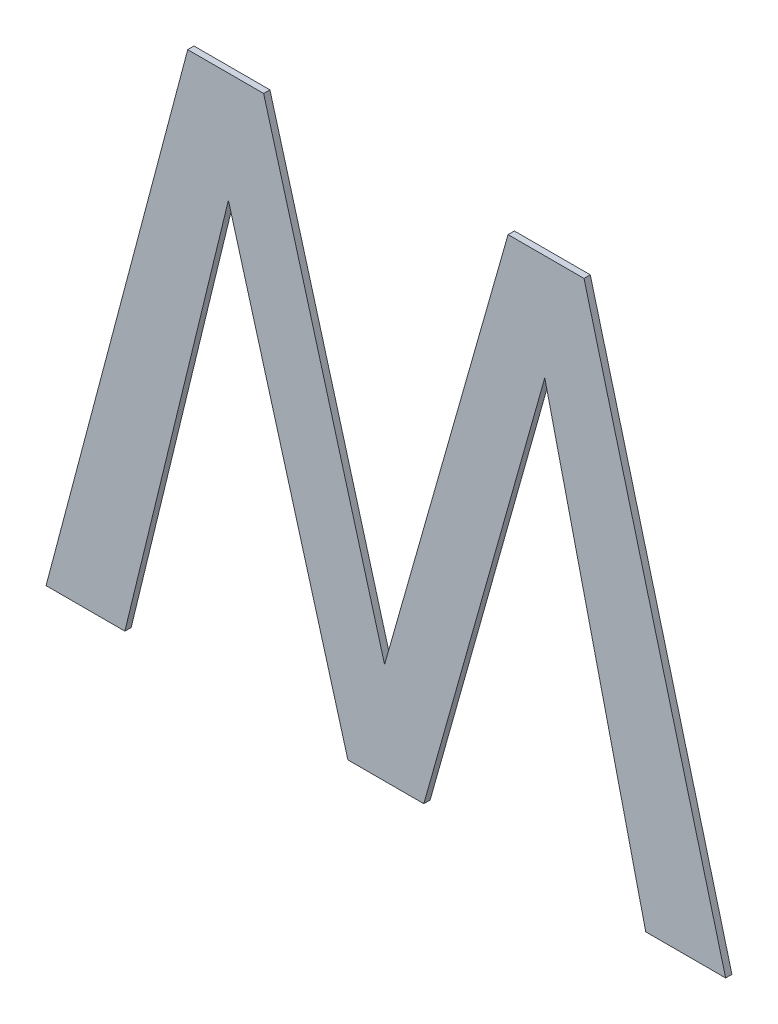
ISO-10303-21;
HEADER;
FILE_DESCRIPTION(('STEP AP214'),'2;1');
FILE_NAME('part.step','',(''),(''),'','','');
FILE_SCHEMA(('AUTOMOTIVE_DESIGN { 1 0 10303 214 1 1 1 1 }'));
ENDSEC;
DATA;
#1=APPLICATION_CONTEXT('core data for automotive mechanical design processes');
#2=APPLICATION_PROTOCOL_DEFINITION('international standard','automotive_design',2000,#1);
#3=PRODUCT_CONTEXT('',#1,'mechanical');
#4=PRODUCT('Part','Part','',(#3));
#5=PRODUCT_RELATED_PRODUCT_CATEGORY('part','',(#4));
#6=PRODUCT_DEFINITION_FORMATION('','',#4);
#7=PRODUCT_DEFINITION_CONTEXT('part definition',#1,'design');
#8=PRODUCT_DEFINITION('design','',#6,#7);
#9=PRODUCT_DEFINITION_SHAPE('','',#8);
#10=(LENGTH_UNIT() NAMED_UNIT(*) SI_UNIT(.MILLI.,.METRE.));
#11=(NAMED_UNIT(*) PLANE_ANGLE_UNIT() SI_UNIT($,.RADIAN.));
#12=(NAMED_UNIT(*) SI_UNIT($,.STERADIAN.) SOLID_ANGLE_UNIT());
#13=UNCERTAINTY_MEASURE_WITH_UNIT(LENGTH_MEASURE(1.E-05),#10,'distance_accuracy_value','');
#14=(GEOMETRIC_REPRESENTATION_CONTEXT(3) GLOBAL_UNCERTAINTY_ASSIGNED_CONTEXT((#13)) GLOBAL_UNIT_ASSIGNED_CONTEXT((#10,
#11,#12)) REPRESENTATION_CONTEXT('',''));
#15=CARTESIAN_POINT('',(0.,0.,0.));
#16=DIRECTION('',(0.,0.,1.));
#17=DIRECTION('',(1.,0.,0.));
#18=AXIS2_PLACEMENT_3D('',#15,#16,#17);
#19=CARTESIAN_POINT('',(0.855597944876126,0.0653781223592418,-3.53695));
#20=DIRECTION('',(0.,0.,1.));
#21=DIRECTION('',(1.,0.,0.));
#22=AXIS2_PLACEMENT_3D('',#19,#20,#21);
#23=PLANE('',#22);
#24=DIRECTION('',(-0.268433706450194,0.96329816009448,0.));
#25=VECTOR('',#24,1.);
#26=CARTESIAN_POINT('',(0.793295570871268,0.116319490612344,-3.53695));
#27=LINE('',#26,#25);
#28=CARTESIAN_POINT('',(0.854315267318052,-0.102655101267517,-3.53695));
#29=VERTEX_POINT('',#28);
#30=CARTESIAN_POINT('',(0.73227587442447,0.335294082492275,-3.53695));
#31=VERTEX_POINT('',#30);
#32=EDGE_CURVE('E170',#29,#31,#27,.T.);
#33=ORIENTED_EDGE('',*,*,#32,.F.);
#34=DIRECTION('',(0.273657890492406,0.961827094113722,0.));
#35=VECTOR('',#34,1.);
#36=CARTESIAN_POINT('',(0.916617655400088,0.116319490612395,-3.53695));
#37=LINE('',#36,#35);
#38=CARTESIAN_POINT('',(0.978920043482131,0.335294082492283,-3.53695));
#39=VERTEX_POINT('',#38);
#40=EDGE_CURVE('E163',#29,#39,#37,.T.);
#41=ORIENTED_EDGE('',*,*,#40,.T.);
#42=DIRECTION('',(1.,0.,0.));
#43=VECTOR('',#42,1.);
#44=CARTESIAN_POINT('',(1.01721769222704,0.335294082492282,-3.53695));
#45=LINE('',#44,#43);
#46=CARTESIAN_POINT('',(1.05551534097171,0.335294082492285,-3.53695));
#47=VERTEX_POINT('',#46);
#48=EDGE_CURVE('E160',#47,#39,#45,.F.);
#49=ORIENTED_EDGE('',*,*,#48,.F.);
#50=DIRECTION('',(-0.255946634271697,0.966690912549089,0.));
#51=VECTOR('',#50,1.);
#52=CARTESIAN_POINT('',(1.1269798397432,0.0653781223592418,-3.53695));
#53=LINE('',#52,#51);
#54=CARTESIAN_POINT('',(1.1984443385147,-0.204537837773794,-3.53695));
#55=VERTEX_POINT('',#54);
#56=EDGE_CURVE('E155',#55,#47,#53,.T.);
#57=ORIENTED_EDGE('',*,*,#56,.F.);
#58=DIRECTION('',(1.,0.,0.));
#59=VECTOR('',#58,1.);
#60=CARTESIAN_POINT('',(1.15813102573992,-0.204537837773798,-3.53695));
#61=LINE('',#60,#59);
#62=CARTESIAN_POINT('',(1.11781771296539,-0.204537837773784,-3.53695));
#63=VERTEX_POINT('',#62);
#64=EDGE_CURVE('E148',#55,#63,#61,.F.);
#65=ORIENTED_EDGE('',*,*,#64,.T.);
#66=DIRECTION('',(-0.228947452945893,0.973438782764272,0.));
#67=VECTOR('',#66,1.);
#68=CARTESIAN_POINT('',(1.06687636080054,0.0120546038789736,-3.53695));
#69=LINE('',#68,#67);
#70=CARTESIAN_POINT('',(1.01593500863569,0.22864704553169,-3.53695));
#71=VERTEX_POINT('',#70);
#72=EDGE_CURVE('E144',#63,#71,#69,.T.);
#73=ORIENTED_EDGE('',*,*,#72,.T.);
#74=DIRECTION('',(0.271170057622003,0.96253145395321,0.));
#75=VECTOR('',#74,1.);
#76=CARTESIAN_POINT('',(0.954915304144744,0.0120546038789457,-3.53695));
#77=LINE('',#76,#75);
#78=CARTESIAN_POINT('',(0.893895599653794,-0.204537837773793,-3.53695));
#79=VERTEX_POINT('',#78);
#80=EDGE_CURVE('E141',#79,#71,#77,.T.);
#81=ORIENTED_EDGE('',*,*,#80,.F.);
#82=DIRECTION('',(1.,0.,0.));
#83=VECTOR('',#82,1.);
#84=CARTESIAN_POINT('',(0.855597950909134,-0.204537837773798,-3.53695));
#85=LINE('',#84,#83);
#86=CARTESIAN_POINT('',(0.817300302164499,-0.20453783777378,-3.53695));
#87=VERTEX_POINT('',#86);
#88=EDGE_CURVE('E134',#79,#87,#85,.F.);
#89=ORIENTED_EDGE('',*,*,#88,.T.);
#90=DIRECTION('',(-0.270697903798296,0.962664346945086,0.));
#91=VECTOR('',#90,1.);
#92=CARTESIAN_POINT('',(0.75701357811231,0.0098556947393712,-3.53695));
#93=LINE('',#92,#91);
#94=CARTESIAN_POINT('',(0.696726854060111,0.224249227252537,-3.53695));
#95=VERTEX_POINT('',#94);
#96=EDGE_CURVE('E109',#87,#95,#93,.T.);
#97=ORIENTED_EDGE('',*,*,#96,.T.);
#98=DIRECTION('',(0.236669409255408,0.971590238075032,0.));
#99=VECTOR('',#98,1.);
#100=CARTESIAN_POINT('',(0.644502790149576,0.0098556947393712,-3.53695));
#101=LINE('',#100,#99);
#102=CARTESIAN_POINT('',(0.59227872623902,-0.204537837773801,-3.53695));
#103=VERTEX_POINT('',#102);
#104=EDGE_CURVE('E121',#103,#95,#101,.T.);
#105=ORIENTED_EDGE('',*,*,#104,.F.);
#106=DIRECTION('',(1.,0.,0.));
#107=VECTOR('',#106,1.);
#108=CARTESIAN_POINT('',(0.55251513873815,-0.204537837773798,-3.53695));
#109=LINE('',#108,#107);
#110=CARTESIAN_POINT('',(0.512751551237545,-0.204537837773799,-3.53695));
#111=VERTEX_POINT('',#110);
#112=EDGE_CURVE('E19',#103,#111,#109,.F.);
#113=ORIENTED_EDGE('',*,*,#112,.T.);
#114=DIRECTION('',(0.255946681385797,0.966690900074888,0.));
#115=VECTOR('',#114,1.);
#116=CARTESIAN_POINT('',(0.584216064086236,0.0653781223592418,-3.53695));
#117=LINE('',#116,#115);
#118=CARTESIAN_POINT('',(0.655680576934927,0.335294082492282,-3.53695));
#119=VERTEX_POINT('',#118);
#120=EDGE_CURVE('E177',#111,#119,#117,.T.);
#121=ORIENTED_EDGE('',*,*,#120,.T.);
#122=DIRECTION('',(1.,0.,0.));
#123=VECTOR('',#122,1.);
#124=CARTESIAN_POINT('',(0.693978225679584,0.335294082492282,-3.53695));
#125=LINE('',#124,#123);
#126=EDGE_CURVE('E175',#31,#119,#125,.F.);
#127=ORIENTED_EDGE('',*,*,#126,.F.);
#128=EDGE_LOOP('',(#33,#41,#49,#57,#65,#73,#81,#89,#97,#105,#113,#121,#127));
#129=FACE_BOUND('',#128,.T.);
#130=ADVANCED_FACE('F16',(#129),#23,.F.);
#131=CARTESIAN_POINT('',(0.55251513873815,-0.204537837773798,-3.533775));
#132=DIRECTION('',(0.,1.,0.));
#133=DIRECTION('',(0.,0.,1.));
#134=AXIS2_PLACEMENT_3D('',#131,#132,#133);
#135=PLANE('',#134);
#136=DIRECTION('',(1.,0.,0.));
#137=VECTOR('',#136,1.);
#138=CARTESIAN_POINT('',(0.855597944876126,-0.204537837773798,-3.5306));
#139=LINE('',#138,#137);
#140=CARTESIAN_POINT('',(0.512751551237545,-0.204537837773799,-3.5306));
#141=VERTEX_POINT('',#140);
#142=CARTESIAN_POINT('',(0.59227872623902,-0.204537837773801,-3.5306));
#143=VERTEX_POINT('',#142);
#144=EDGE_CURVE('E181',#141,#143,#139,.T.);
#145=ORIENTED_EDGE('',*,*,#144,.F.);
#146=DIRECTION('',(0.,0.,1.));
#147=VECTOR('',#146,1.);
#148=CARTESIAN_POINT('',(0.512751551237547,-0.204537837773799,-3.533775));
#149=LINE('',#148,#147);
#150=EDGE_CURVE('E119',#141,#111,#149,.F.);
#151=ORIENTED_EDGE('',*,*,#150,.T.);
#152=ORIENTED_EDGE('',*,*,#112,.F.);
#153=DIRECTION('',(0.,0.,1.));
#154=VECTOR('',#153,1.);
#155=CARTESIAN_POINT('',(0.592278726239049,-0.204537837773808,-3.533775));
#156=LINE('',#155,#154);
#157=EDGE_CURVE('E116',#143,#103,#156,.F.);
#158=ORIENTED_EDGE('',*,*,#157,.F.);
#159=EDGE_LOOP('',(#145,#151,#152,#158));
#160=FACE_BOUND('',#159,.T.);
#161=ADVANCED_FACE('F114',(#160),#135,.F.);
#162=CARTESIAN_POINT('',(0.644502790149576,0.0098556947393712,-3.533775));
#163=DIRECTION('',(0.971590238075032,-0.236669409255408,0.));
#164=DIRECTION('',(0.236669409255408,0.971590238075032,0.));
#165=AXIS2_PLACEMENT_3D('',#162,#163,#164);
#166=PLANE('',#165);
#167=ORIENTED_EDGE('',*,*,#157,.T.);
#168=ORIENTED_EDGE('',*,*,#104,.T.);
#169=DIRECTION('',(0.,0.,1.));
#170=VECTOR('',#169,1.);
#171=CARTESIAN_POINT('',(0.696726854060057,0.224249227252517,-3.533775));
#172=LINE('',#171,#170);
#173=CARTESIAN_POINT('',(0.696726854060101,0.22424922725254,-3.5306));
#174=VERTEX_POINT('',#173);
#175=EDGE_CURVE('E132',#95,#174,#172,.T.);
#176=ORIENTED_EDGE('',*,*,#175,.T.);
#177=DIRECTION('',(0.236669409255586,0.971590238074988,0.));
#178=VECTOR('',#177,1.);
#179=CARTESIAN_POINT('',(0.59227872623901,-0.204537837773798,-3.5306));
#180=LINE('',#179,#178);
#181=EDGE_CURVE('E128',#143,#174,#180,.T.);
#182=ORIENTED_EDGE('',*,*,#181,.F.);
#183=EDGE_LOOP('',(#167,#168,#176,#182));
#184=FACE_BOUND('',#183,.T.);
#185=ADVANCED_FACE('F126',(#184),#166,.T.);
#186=CARTESIAN_POINT('',(0.75701357811231,0.0098556947393712,-3.533775));
#187=DIRECTION('',(0.962664346945086,0.270697903798296,0.));
#188=DIRECTION('',(-0.270697903798296,0.962664346945086,0.));
#189=AXIS2_PLACEMENT_3D('',#186,#187,#188);
#190=PLANE('',#189);
#191=DIRECTION('',(0.270697903797916,-0.962664346945193,0.));
#192=VECTOR('',#191,1.);
#193=CARTESIAN_POINT('',(0.696726854060142,0.224249227252541,-3.5306));
#194=LINE('',#193,#192);
#195=CARTESIAN_POINT('',(0.81730030216452,-0.204537837773786,-3.5306));
#196=VERTEX_POINT('',#195);
#197=EDGE_CURVE('E184',#174,#196,#194,.T.);
#198=ORIENTED_EDGE('',*,*,#197,.F.);
#199=ORIENTED_EDGE('',*,*,#175,.F.);
#200=ORIENTED_EDGE('',*,*,#96,.F.);
#201=DIRECTION('',(0.,0.,1.));
#202=VECTOR('',#201,1.);
#203=CARTESIAN_POINT('',(0.817300302164478,-0.204537837773798,-3.533775));
#204=LINE('',#203,#202);
#205=EDGE_CURVE('E136',#87,#196,#204,.T.);
#206=ORIENTED_EDGE('',*,*,#205,.T.);
#207=EDGE_LOOP('',(#198,#199,#200,#206));
#208=FACE_BOUND('',#207,.T.);
#209=ADVANCED_FACE('F260',(#208),#190,.F.);
#210=CARTESIAN_POINT('',(0.855597950909134,-0.204537837773798,-3.533775));
#211=DIRECTION('',(0.,1.,0.));
#212=DIRECTION('',(0.,0.,1.));
#213=AXIS2_PLACEMENT_3D('',#210,#211,#212);
#214=PLANE('',#213);
#215=DIRECTION('',(1.,0.,0.));
#216=VECTOR('',#215,1.);
#217=CARTESIAN_POINT('',(0.855597944876126,-0.204537837773798,-3.5306));
#218=LINE('',#217,#216);
#219=CARTESIAN_POINT('',(0.893895599653792,-0.204537837773799,-3.5306));
#220=VERTEX_POINT('',#219);
#221=EDGE_CURVE('E187',#196,#220,#218,.T.);
#222=ORIENTED_EDGE('',*,*,#221,.F.);
#223=ORIENTED_EDGE('',*,*,#205,.F.);
#224=ORIENTED_EDGE('',*,*,#88,.F.);
#225=DIRECTION('',(0.,0.,1.));
#226=VECTOR('',#225,1.);
#227=CARTESIAN_POINT('',(0.893895599653798,-0.204537837773801,-3.533775));
#228=LINE('',#227,#226);
#229=EDGE_CURVE('E138',#220,#79,#228,.F.);
#230=ORIENTED_EDGE('',*,*,#229,.F.);
#231=EDGE_LOOP('',(#222,#223,#224,#230));
#232=FACE_BOUND('',#231,.T.);
#233=ADVANCED_FACE('F256',(#232),#214,.F.);
#234=CARTESIAN_POINT('',(0.954915304144744,0.0120546038789457,-3.533775));
#235=DIRECTION('',(0.96253145395321,-0.271170057622003,0.));
#236=DIRECTION('',(0.271170057622003,0.96253145395321,0.));
#237=AXIS2_PLACEMENT_3D('',#234,#235,#236);
#238=PLANE('',#237);
#239=ORIENTED_EDGE('',*,*,#229,.T.);
#240=ORIENTED_EDGE('',*,*,#80,.T.);
#241=DIRECTION('',(0.,0.,1.));
#242=VECTOR('',#241,1.);
#243=CARTESIAN_POINT('',(1.01593500863569,0.228647045531688,-3.533775));
#244=LINE('',#243,#242);
#245=CARTESIAN_POINT('',(1.01593500863569,0.22864704553169,-3.5306));
#246=VERTEX_POINT('',#245);
#247=EDGE_CURVE('E146',#71,#246,#244,.T.);
#248=ORIENTED_EDGE('',*,*,#247,.T.);
#249=DIRECTION('',(0.271170057622038,0.9625314539532,0.));
#250=VECTOR('',#249,1.);
#251=CARTESIAN_POINT('',(0.89389559965379,-0.204537837773798,-3.5306));
#252=LINE('',#251,#250);
#253=EDGE_CURVE('E190',#220,#246,#252,.T.);
#254=ORIENTED_EDGE('',*,*,#253,.F.);
#255=EDGE_LOOP('',(#239,#240,#248,#254));
#256=FACE_BOUND('',#255,.T.);
#257=ADVANCED_FACE('F252',(#256),#238,.T.);
#258=CARTESIAN_POINT('',(1.06687636080054,0.0120546038789736,-3.533775));
#259=DIRECTION('',(0.973438782764272,0.228947452945893,0.));
#260=DIRECTION('',(-0.228947452945893,0.973438782764272,0.));
#261=AXIS2_PLACEMENT_3D('',#258,#259,#260);
#262=PLANE('',#261);
#263=DIRECTION('',(0.228947452945823,-0.973438782764289,0.));
#264=VECTOR('',#263,1.);
#265=CARTESIAN_POINT('',(1.0159350086357,0.22864704553169,-3.5306));
#266=LINE('',#265,#264);
#267=CARTESIAN_POINT('',(1.1178177129654,-0.204537837773796,-3.5306));
#268=VERTEX_POINT('',#267);
#269=EDGE_CURVE('E193',#246,#268,#266,.T.);
#270=ORIENTED_EDGE('',*,*,#269,.F.);
#271=ORIENTED_EDGE('',*,*,#247,.F.);
#272=ORIENTED_EDGE('',*,*,#72,.F.);
#273=DIRECTION('',(0.,0.,1.));
#274=VECTOR('',#273,1.);
#275=CARTESIAN_POINT('',(1.11781771296539,-0.204537837773798,-3.533775));
#276=LINE('',#275,#274);
#277=EDGE_CURVE('E150',#63,#268,#276,.T.);
#278=ORIENTED_EDGE('',*,*,#277,.T.);
#279=EDGE_LOOP('',(#270,#271,#272,#278));
#280=FACE_BOUND('',#279,.T.);
#281=ADVANCED_FACE('F248',(#280),#262,.F.);
#282=CARTESIAN_POINT('',(1.15813102573992,-0.204537837773798,-3.533775));
#283=DIRECTION('',(0.,1.,0.));
#284=DIRECTION('',(0.,0.,1.));
#285=AXIS2_PLACEMENT_3D('',#282,#283,#284);
#286=PLANE('',#285);
#287=DIRECTION('',(1.,0.,0.));
#288=VECTOR('',#287,1.);
#289=CARTESIAN_POINT('',(0.855597944876126,-0.204537837773798,-3.5306));
#290=LINE('',#289,#288);
#291=CARTESIAN_POINT('',(1.1984443385147,-0.2045378377738,-3.5306));
#292=VERTEX_POINT('',#291);
#293=EDGE_CURVE('E196',#268,#292,#290,.T.);
#294=ORIENTED_EDGE('',*,*,#293,.F.);
#295=ORIENTED_EDGE('',*,*,#277,.F.);
#296=ORIENTED_EDGE('',*,*,#64,.F.);
#297=DIRECTION('',(0.,0.,1.));
#298=VECTOR('',#297,1.);
#299=CARTESIAN_POINT('',(1.19844433851469,-0.204537837773804,-3.533775));
#300=LINE('',#299,#298);
#301=EDGE_CURVE('E152',#292,#55,#300,.F.);
#302=ORIENTED_EDGE('',*,*,#301,.F.);
#303=EDGE_LOOP('',(#294,#295,#296,#302));
#304=FACE_BOUND('',#303,.T.);
#305=ADVANCED_FACE('F244',(#304),#286,.F.);
#306=CARTESIAN_POINT('',(1.1269798397432,0.0653781223592418,-3.533775));
#307=DIRECTION('',(0.966690912549089,0.255946634271697,0.));
#308=DIRECTION('',(-0.255946634271697,0.966690912549089,0.));
#309=AXIS2_PLACEMENT_3D('',#306,#307,#308);
#310=PLANE('',#309);
#311=ORIENTED_EDGE('',*,*,#301,.T.);
#312=ORIENTED_EDGE('',*,*,#56,.T.);
#313=DIRECTION('',(0.,0.,1.));
#314=VECTOR('',#313,1.);
#315=CARTESIAN_POINT('',(1.0555153409717,0.335294082492282,-3.533775));
#316=LINE('',#315,#314);
#317=CARTESIAN_POINT('',(1.05551534097171,0.335294082492285,-3.5306));
#318=VERTEX_POINT('',#317);
#319=EDGE_CURVE('E157',#318,#47,#316,.F.);
#320=ORIENTED_EDGE('',*,*,#319,.F.);
#321=DIRECTION('',(-0.255946634271777,0.966690912549068,0.));
#322=VECTOR('',#321,1.);
#323=CARTESIAN_POINT('',(1.19844433851471,-0.204537837773798,-3.5306));
#324=LINE('',#323,#322);
#325=EDGE_CURVE('E199',#292,#318,#324,.T.);
#326=ORIENTED_EDGE('',*,*,#325,.F.);
#327=EDGE_LOOP('',(#311,#312,#320,#326));
#328=FACE_BOUND('',#327,.T.);
#329=ADVANCED_FACE('F240',(#328),#310,.T.);
#330=CARTESIAN_POINT('',(1.01721769222704,0.335294082492282,-3.533775));
#331=DIRECTION('',(0.,1.,0.));
#332=DIRECTION('',(0.,0.,1.));
#333=AXIS2_PLACEMENT_3D('',#330,#331,#332);
#334=PLANE('',#333);
#335=ORIENTED_EDGE('',*,*,#319,.T.);
#336=ORIENTED_EDGE('',*,*,#48,.T.);
#337=DIRECTION('',(0.,0.,1.));
#338=VECTOR('',#337,1.);
#339=CARTESIAN_POINT('',(0.97892004348212,0.335294082492286,-3.533775));
#340=LINE('',#339,#338);
#341=CARTESIAN_POINT('',(0.978920043482131,0.335294082492283,-3.5306));
#342=VERTEX_POINT('',#341);
#343=EDGE_CURVE('E165',#39,#342,#340,.T.);
#344=ORIENTED_EDGE('',*,*,#343,.T.);
#345=DIRECTION('',(1.,0.,0.));
#346=VECTOR('',#345,1.);
#347=CARTESIAN_POINT('',(0.855597944876126,0.335294082492282,-3.5306));
#348=LINE('',#347,#346);
#349=EDGE_CURVE('E202',#318,#342,#348,.F.);
#350=ORIENTED_EDGE('',*,*,#349,.F.);
#351=EDGE_LOOP('',(#335,#336,#344,#350));
#352=FACE_BOUND('',#351,.T.);
#353=ADVANCED_FACE('F236',(#352),#334,.T.);
#354=CARTESIAN_POINT('',(0.916617655400088,0.116319490612395,-3.533775));
#355=DIRECTION('',(0.961827094113722,-0.273657890492406,0.));
#356=DIRECTION('',(0.273657890492406,0.961827094113722,0.));
#357=AXIS2_PLACEMENT_3D('',#354,#355,#356);
#358=PLANE('',#357);
#359=DIRECTION('',(-0.273657890492452,-0.961827094113709,0.));
#360=VECTOR('',#359,1.);
#361=CARTESIAN_POINT('',(0.978920043482134,0.335294082492282,-3.5306));
#362=LINE('',#361,#360);
#363=CARTESIAN_POINT('',(0.854315267318052,-0.102655101267517,-3.5306));
#364=VERTEX_POINT('',#363);
#365=EDGE_CURVE('E205',#342,#364,#362,.T.);
#366=ORIENTED_EDGE('',*,*,#365,.F.);
#367=ORIENTED_EDGE('',*,*,#343,.F.);
#368=ORIENTED_EDGE('',*,*,#40,.F.);
#369=DIRECTION('',(0.,0.,1.));
#370=VECTOR('',#369,1.);
#371=CARTESIAN_POINT('',(0.85431526731807,-0.10265510126751,-3.533775));
#372=LINE('',#371,#370);
#373=EDGE_CURVE('E167',#364,#29,#372,.F.);
#374=ORIENTED_EDGE('',*,*,#373,.F.);
#375=EDGE_LOOP('',(#366,#367,#368,#374));
#376=FACE_BOUND('',#375,.T.);
#377=ADVANCED_FACE('F233',(#376),#358,.F.);
#378=CARTESIAN_POINT('',(0.793295570871268,0.116319490612344,-3.533775));
#379=DIRECTION('',(0.96329816009448,0.268433706450194,0.));
#380=DIRECTION('',(-0.268433706450194,0.96329816009448,0.));
#381=AXIS2_PLACEMENT_3D('',#378,#379,#380);
#382=PLANE('',#381);
#383=ORIENTED_EDGE('',*,*,#373,.T.);
#384=ORIENTED_EDGE('',*,*,#32,.T.);
#385=DIRECTION('',(0.,0.,1.));
#386=VECTOR('',#385,1.);
#387=CARTESIAN_POINT('',(0.732275874424494,0.335294082492282,-3.533775));
#388=LINE('',#387,#386);
#389=CARTESIAN_POINT('',(0.73227587442447,0.335294082492275,-3.5306));
#390=VERTEX_POINT('',#389);
#391=EDGE_CURVE('E172',#390,#31,#388,.F.);
#392=ORIENTED_EDGE('',*,*,#391,.F.);
#393=DIRECTION('',(-0.268433706450029,0.963298160094526,0.));
#394=VECTOR('',#393,1.);
#395=CARTESIAN_POINT('',(0.854315267318042,-0.102655101267517,-3.5306));
#396=LINE('',#395,#394);
#397=EDGE_CURVE('E208',#364,#390,#396,.T.);
#398=ORIENTED_EDGE('',*,*,#397,.F.);
#399=EDGE_LOOP('',(#383,#384,#392,#398));
#400=FACE_BOUND('',#399,.T.);
#401=ADVANCED_FACE('F218',(#400),#382,.T.);
#402=CARTESIAN_POINT('',(0.693978225679584,0.335294082492282,-3.533775));
#403=DIRECTION('',(0.,1.,0.));
#404=DIRECTION('',(0.,0.,1.));
#405=AXIS2_PLACEMENT_3D('',#402,#403,#404);
#406=PLANE('',#405);
#407=ORIENTED_EDGE('',*,*,#391,.T.);
#408=ORIENTED_EDGE('',*,*,#126,.T.);
#409=DIRECTION('',(0.,0.,1.));
#410=VECTOR('',#409,1.);
#411=CARTESIAN_POINT('',(0.655680576934925,0.335294082492283,-3.533775));
#412=LINE('',#411,#410);
#413=CARTESIAN_POINT('',(0.655680576934927,0.335294082492282,-3.5306));
#414=VERTEX_POINT('',#413);
#415=EDGE_CURVE('E34',#119,#414,#412,.T.);
#416=ORIENTED_EDGE('',*,*,#415,.T.);
#417=DIRECTION('',(1.,0.,0.));
#418=VECTOR('',#417,1.);
#419=CARTESIAN_POINT('',(0.855597944876126,0.335294082492282,-3.5306));
#420=LINE('',#419,#418);
#421=EDGE_CURVE('E25',#390,#414,#420,.F.);
#422=ORIENTED_EDGE('',*,*,#421,.F.);
#423=EDGE_LOOP('',(#407,#408,#416,#422));
#424=FACE_BOUND('',#423,.T.);
#425=ADVANCED_FACE('F215',(#424),#406,.T.);
#426=CARTESIAN_POINT('',(0.584216064086236,0.0653781223592418,-3.533775));
#427=DIRECTION('',(0.966690900074888,-0.255946681385797,0.));
#428=DIRECTION('',(0.255946681385797,0.966690900074888,0.));
#429=AXIS2_PLACEMENT_3D('',#426,#427,#428);
#430=PLANE('',#429);
#431=DIRECTION('',(-0.255946681385807,-0.966690900074885,0.));
#432=VECTOR('',#431,1.);
#433=CARTESIAN_POINT('',(0.655680576934928,0.335294082492282,-3.5306));
#434=LINE('',#433,#432);
#435=EDGE_CURVE('E11',#414,#141,#434,.T.);
#436=ORIENTED_EDGE('',*,*,#435,.F.);
#437=ORIENTED_EDGE('',*,*,#415,.F.);
#438=ORIENTED_EDGE('',*,*,#120,.F.);
#439=ORIENTED_EDGE('',*,*,#150,.F.);
#440=EDGE_LOOP('',(#436,#437,#438,#439));
#441=FACE_BOUND('',#440,.T.);
#442=ADVANCED_FACE('F220',(#441),#430,.F.);
#443=CARTESIAN_POINT('',(0.855597944876126,0.0653781223592418,-3.5306));
#444=DIRECTION('',(0.,0.,1.));
#445=DIRECTION('',(1.,0.,0.));
#446=AXIS2_PLACEMENT_3D('',#443,#444,#445);
#447=PLANE('',#446);
#448=ORIENTED_EDGE('',*,*,#421,.T.);
#449=ORIENTED_EDGE('',*,*,#435,.T.);
#450=ORIENTED_EDGE('',*,*,#144,.T.);
#451=ORIENTED_EDGE('',*,*,#181,.T.);
#452=ORIENTED_EDGE('',*,*,#197,.T.);
#453=ORIENTED_EDGE('',*,*,#221,.T.);
#454=ORIENTED_EDGE('',*,*,#253,.T.);
#455=ORIENTED_EDGE('',*,*,#269,.T.);
#456=ORIENTED_EDGE('',*,*,#293,.T.);
#457=ORIENTED_EDGE('',*,*,#325,.T.);
#458=ORIENTED_EDGE('',*,*,#349,.T.);
#459=ORIENTED_EDGE('',*,*,#365,.T.);
#460=ORIENTED_EDGE('',*,*,#397,.T.);
#461=EDGE_LOOP('',(#448,#449,#450,#451,#452,#453,#454,#455,#456,#457,#458,#459,#460));
#462=FACE_BOUND('',#461,.T.);
#463=ADVANCED_FACE('F213',(#462),#447,.T.);
#464=CLOSED_SHELL('',(#130,#161,#185,#209,#233,#257,#281,#305,#329,#353,#377,#401,#425,#442,#463));
#465=MANIFOLD_SOLID_BREP('B1',#464);
#466=ADVANCED_BREP_SHAPE_REPRESENTATION('',(#18,#465),#14);
#467=SHAPE_DEFINITION_REPRESENTATION(#9,#466);
ENDSEC;
END-ISO-10303-21;
